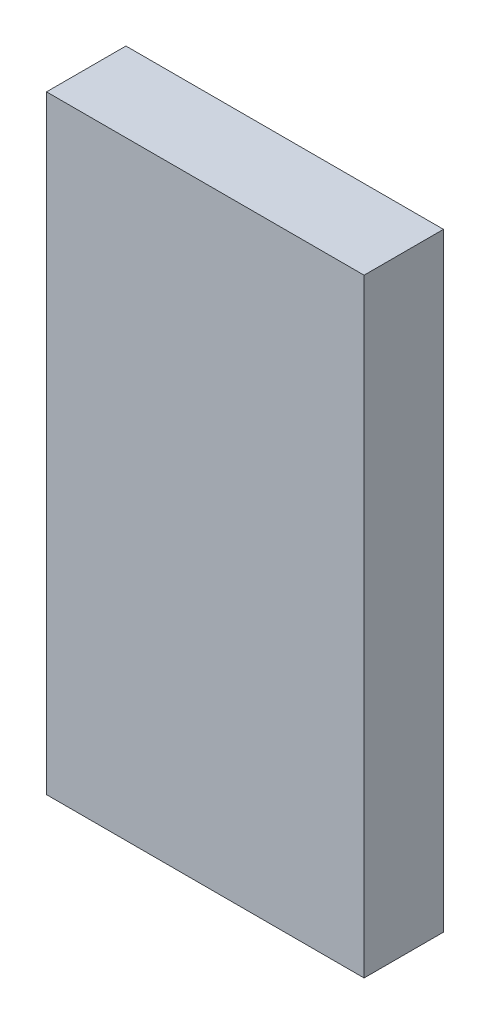
ISO-10303-21;
HEADER;
FILE_DESCRIPTION(('STEP AP214'),'2;1');
FILE_NAME('part.step','',(''),(''),'','','');
FILE_SCHEMA(('AUTOMOTIVE_DESIGN { 1 0 10303 214 1 1 1 1 }'));
ENDSEC;
DATA;
#1=APPLICATION_CONTEXT('core data for automotive mechanical design processes');
#2=APPLICATION_PROTOCOL_DEFINITION('international standard','automotive_design',2000,#1);
#3=PRODUCT_CONTEXT('',#1,'mechanical');
#4=PRODUCT('Part','Part','',(#3));
#5=PRODUCT_RELATED_PRODUCT_CATEGORY('part','',(#4));
#6=PRODUCT_DEFINITION_FORMATION('','',#4);
#7=PRODUCT_DEFINITION_CONTEXT('part definition',#1,'design');
#8=PRODUCT_DEFINITION('design','',#6,#7);
#9=PRODUCT_DEFINITION_SHAPE('','',#8);
#10=(LENGTH_UNIT() NAMED_UNIT(*) SI_UNIT(.MILLI.,.METRE.));
#11=(NAMED_UNIT(*) PLANE_ANGLE_UNIT() SI_UNIT($,.RADIAN.));
#12=(NAMED_UNIT(*) SI_UNIT($,.STERADIAN.) SOLID_ANGLE_UNIT());
#13=UNCERTAINTY_MEASURE_WITH_UNIT(LENGTH_MEASURE(1.E-05),#10,'distance_accuracy_value','');
#14=(GEOMETRIC_REPRESENTATION_CONTEXT(3) GLOBAL_UNCERTAINTY_ASSIGNED_CONTEXT((#13)) GLOBAL_UNIT_ASSIGNED_CONTEXT((#10,
#11,#12)) REPRESENTATION_CONTEXT('',''));
#15=CARTESIAN_POINT('',(0.,0.,0.));
#16=DIRECTION('',(0.,0.,1.));
#17=DIRECTION('',(1.,0.,0.));
#18=AXIS2_PLACEMENT_3D('',#15,#16,#17);
#19=CARTESIAN_POINT('',(1.270000026946E-06,0.,0.2999994));
#20=DIRECTION('',(0.,0.,1.));
#21=DIRECTION('',(1.,0.,0.));
#22=AXIS2_PLACEMENT_3D('',#19,#20,#21);
#23=PLANE('',#22);
#24=DIRECTION('',(0.,1.,0.));
#25=VECTOR('',#24,1.);
#26=CARTESIAN_POINT('',(0.5999607,-1.15000024,0.2999994));
#27=LINE('',#26,#25);
#28=CARTESIAN_POINT('',(0.5999607,-1.15000024,0.2999994));
#29=VERTEX_POINT('',#28);
#30=CARTESIAN_POINT('',(0.5999607,1.15000024,0.2999994));
#31=VERTEX_POINT('',#30);
#32=EDGE_CURVE('E89',#29,#31,#27,.T.);
#33=ORIENTED_EDGE('',*,*,#32,.T.);
#34=DIRECTION('',(-1.,0.,0.));
#35=VECTOR('',#34,1.);
#36=CARTESIAN_POINT('',(0.5999607,1.15000024,0.2999994));
#37=LINE('',#36,#35);
#38=CARTESIAN_POINT('',(-0.59995816,1.15000024,0.2999994));
#39=VERTEX_POINT('',#38);
#40=EDGE_CURVE('E75',#31,#39,#37,.T.);
#41=ORIENTED_EDGE('',*,*,#40,.T.);
#42=DIRECTION('',(0.,-1.,0.));
#43=VECTOR('',#42,1.);
#44=CARTESIAN_POINT('',(-0.59995816,1.15000024,0.2999994));
#45=LINE('',#44,#43);
#46=CARTESIAN_POINT('',(-0.59995816,-1.15000024,0.2999994));
#47=VERTEX_POINT('',#46);
#48=EDGE_CURVE('E79',#39,#47,#45,.T.);
#49=ORIENTED_EDGE('',*,*,#48,.T.);
#50=DIRECTION('',(1.,0.,0.));
#51=VECTOR('',#50,1.);
#52=CARTESIAN_POINT('',(-0.59995816,-1.15000024,0.2999994));
#53=LINE('',#52,#51);
#54=EDGE_CURVE('E11',#47,#29,#53,.T.);
#55=ORIENTED_EDGE('',*,*,#54,.T.);
#56=EDGE_LOOP('',(#33,#41,#49,#55));
#57=FACE_BOUND('',#56,.T.);
#58=ADVANCED_FACE('F16',(#57),#23,.T.);
#59=CARTESIAN_POINT('',(1.270000026946E-06,0.,0.));
#60=DIRECTION('',(0.,0.,1.));
#61=DIRECTION('',(1.,0.,0.));
#62=AXIS2_PLACEMENT_3D('',#59,#60,#61);
#63=PLANE('',#62);
#64=DIRECTION('',(0.,1.,0.));
#65=VECTOR('',#64,1.);
#66=CARTESIAN_POINT('',(0.5999607,-1.15000024,0.));
#67=LINE('',#66,#65);
#68=CARTESIAN_POINT('',(0.5999607,-1.15000024,0.));
#69=VERTEX_POINT('',#68);
#70=CARTESIAN_POINT('',(0.5999607,1.15000024,0.));
#71=VERTEX_POINT('',#70);
#72=EDGE_CURVE('E101',#69,#71,#67,.T.);
#73=ORIENTED_EDGE('',*,*,#72,.F.);
#74=DIRECTION('',(1.,0.,0.));
#75=VECTOR('',#74,1.);
#76=CARTESIAN_POINT('',(-0.59995816,-1.15000024,0.));
#77=LINE('',#76,#75);
#78=CARTESIAN_POINT('',(-0.59995816,-1.15000024,0.));
#79=VERTEX_POINT('',#78);
#80=EDGE_CURVE('E27',#79,#69,#77,.T.);
#81=ORIENTED_EDGE('',*,*,#80,.F.);
#82=DIRECTION('',(0.,-1.,0.));
#83=VECTOR('',#82,1.);
#84=CARTESIAN_POINT('',(-0.59995816,1.15000024,0.));
#85=LINE('',#84,#83);
#86=CARTESIAN_POINT('',(-0.59995816,1.15000024,0.));
#87=VERTEX_POINT('',#86);
#88=EDGE_CURVE('E65',#87,#79,#85,.T.);
#89=ORIENTED_EDGE('',*,*,#88,.F.);
#90=DIRECTION('',(-1.,0.,0.));
#91=VECTOR('',#90,1.);
#92=CARTESIAN_POINT('',(0.5999607,1.15000024,0.));
#93=LINE('',#92,#91);
#94=EDGE_CURVE('E20',#71,#87,#93,.T.);
#95=ORIENTED_EDGE('',*,*,#94,.F.);
#96=EDGE_LOOP('',(#73,#81,#89,#95));
#97=FACE_BOUND('',#96,.T.);
#98=ADVANCED_FACE('F68',(#97),#63,.F.);
#99=CARTESIAN_POINT('',(-0.59995816,-1.15000024,0.));
#100=DIRECTION('',(0.,1.,0.));
#101=DIRECTION('',(1.,0.,0.));
#102=AXIS2_PLACEMENT_3D('',#99,#100,#101);
#103=PLANE('',#102);
#104=DIRECTION('',(0.,0.,1.));
#105=VECTOR('',#104,1.);
#106=CARTESIAN_POINT('',(-0.59995816,-1.15000024,0.));
#107=LINE('',#106,#105);
#108=EDGE_CURVE('E74',#79,#47,#107,.T.);
#109=ORIENTED_EDGE('',*,*,#108,.F.);
#110=ORIENTED_EDGE('',*,*,#80,.T.);
#111=DIRECTION('',(0.,0.,1.));
#112=VECTOR('',#111,1.);
#113=CARTESIAN_POINT('',(0.5999607,-1.15000024,0.));
#114=LINE('',#113,#112);
#115=EDGE_CURVE('E108',#69,#29,#114,.T.);
#116=ORIENTED_EDGE('',*,*,#115,.T.);
#117=ORIENTED_EDGE('',*,*,#54,.F.);
#118=EDGE_LOOP('',(#109,#110,#116,#117));
#119=FACE_BOUND('',#118,.T.);
#120=ADVANCED_FACE('F124',(#119),#103,.F.);
#121=CARTESIAN_POINT('',(-0.59995816,1.15000024,0.));
#122=DIRECTION('',(1.,0.,0.));
#123=DIRECTION('',(0.,1.,0.));
#124=AXIS2_PLACEMENT_3D('',#121,#122,#123);
#125=PLANE('',#124);
#126=DIRECTION('',(0.,0.,1.));
#127=VECTOR('',#126,1.);
#128=CARTESIAN_POINT('',(-0.59995816,1.15000024,0.));
#129=LINE('',#128,#127);
#130=EDGE_CURVE('E78',#87,#39,#129,.T.);
#131=ORIENTED_EDGE('',*,*,#130,.F.);
#132=ORIENTED_EDGE('',*,*,#88,.T.);
#133=ORIENTED_EDGE('',*,*,#108,.T.);
#134=ORIENTED_EDGE('',*,*,#48,.F.);
#135=EDGE_LOOP('',(#131,#132,#133,#134));
#136=FACE_BOUND('',#135,.T.);
#137=ADVANCED_FACE('F18',(#136),#125,.F.);
#138=CARTESIAN_POINT('',(0.5999607,1.15000024,0.));
#139=DIRECTION('',(0.,-1.,0.));
#140=DIRECTION('',(0.,0.,-1.));
#141=AXIS2_PLACEMENT_3D('',#138,#139,#140);
#142=PLANE('',#141);
#143=DIRECTION('',(0.,0.,1.));
#144=VECTOR('',#143,1.);
#145=CARTESIAN_POINT('',(0.5999607,1.15000024,0.));
#146=LINE('',#145,#144);
#147=EDGE_CURVE('E86',#71,#31,#146,.T.);
#148=ORIENTED_EDGE('',*,*,#147,.F.);
#149=ORIENTED_EDGE('',*,*,#94,.T.);
#150=ORIENTED_EDGE('',*,*,#130,.T.);
#151=ORIENTED_EDGE('',*,*,#40,.F.);
#152=EDGE_LOOP('',(#148,#149,#150,#151));
#153=FACE_BOUND('',#152,.T.);
#154=ADVANCED_FACE('F84',(#153),#142,.F.);
#155=CARTESIAN_POINT('',(0.5999607,-1.15000024,0.));
#156=DIRECTION('',(-1.,0.,0.));
#157=DIRECTION('',(0.,0.,1.));
#158=AXIS2_PLACEMENT_3D('',#155,#156,#157);
#159=PLANE('',#158);
#160=ORIENTED_EDGE('',*,*,#115,.F.);
#161=ORIENTED_EDGE('',*,*,#72,.T.);
#162=ORIENTED_EDGE('',*,*,#147,.T.);
#163=ORIENTED_EDGE('',*,*,#32,.F.);
#164=EDGE_LOOP('',(#160,#161,#162,#163));
#165=FACE_BOUND('',#164,.T.);
#166=ADVANCED_FACE('F125',(#165),#159,.F.);
#167=CLOSED_SHELL('',(#58,#98,#120,#137,#154,#166));
#168=MANIFOLD_SOLID_BREP('B1',#167);
#169=ADVANCED_BREP_SHAPE_REPRESENTATION('',(#18,#168),#14);
#170=SHAPE_DEFINITION_REPRESENTATION(#9,#169);
ENDSEC;
END-ISO-10303-21;
